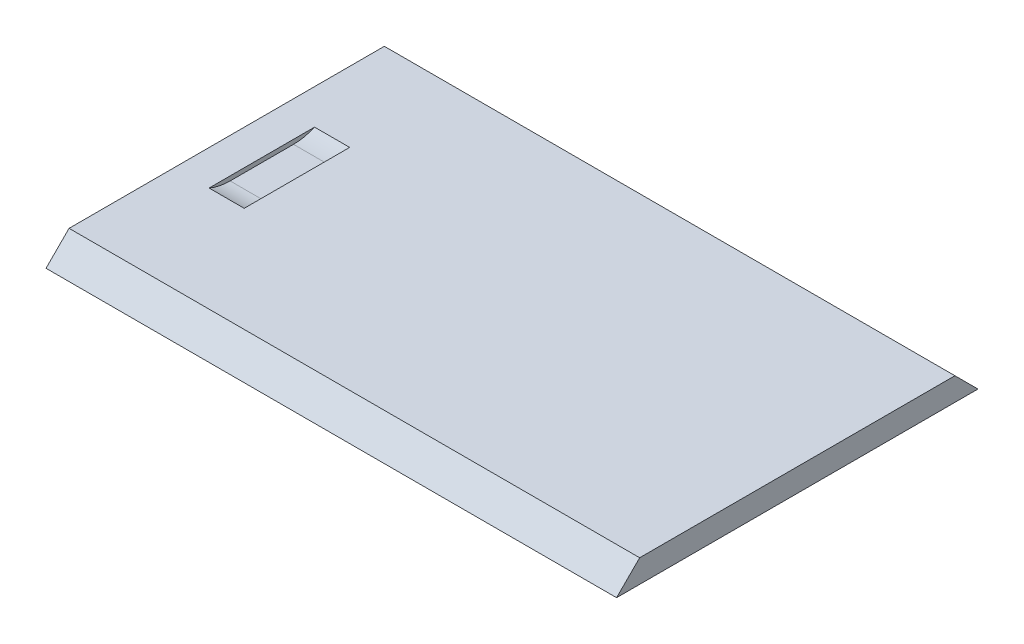
ISO-10303-21;
HEADER;
FILE_DESCRIPTION(('STEP AP214'),'2;1');
FILE_NAME('part.step','',(''),(''),'','','');
FILE_SCHEMA(('AUTOMOTIVE_DESIGN { 1 0 10303 214 1 1 1 1 }'));
ENDSEC;
DATA;
#1=APPLICATION_CONTEXT('core data for automotive mechanical design processes');
#2=APPLICATION_PROTOCOL_DEFINITION('international standard','automotive_design',2000,#1);
#3=PRODUCT_CONTEXT('',#1,'mechanical');
#4=PRODUCT('Part','Part','',(#3));
#5=PRODUCT_RELATED_PRODUCT_CATEGORY('part','',(#4));
#6=PRODUCT_DEFINITION_FORMATION('','',#4);
#7=PRODUCT_DEFINITION_CONTEXT('part definition',#1,'design');
#8=PRODUCT_DEFINITION('design','',#6,#7);
#9=PRODUCT_DEFINITION_SHAPE('','',#8);
#10=(LENGTH_UNIT() NAMED_UNIT(*) SI_UNIT(.MILLI.,.METRE.));
#11=(NAMED_UNIT(*) PLANE_ANGLE_UNIT() SI_UNIT($,.RADIAN.));
#12=(NAMED_UNIT(*) SI_UNIT($,.STERADIAN.) SOLID_ANGLE_UNIT());
#13=UNCERTAINTY_MEASURE_WITH_UNIT(LENGTH_MEASURE(1.E-05),#10,'distance_accuracy_value','');
#14=(GEOMETRIC_REPRESENTATION_CONTEXT(3) GLOBAL_UNCERTAINTY_ASSIGNED_CONTEXT((#13)) GLOBAL_UNIT_ASSIGNED_CONTEXT((#10,
#11,#12)) REPRESENTATION_CONTEXT('',''));
#15=CARTESIAN_POINT('',(0.,0.,0.));
#16=DIRECTION('',(0.,0.,1.));
#17=DIRECTION('',(1.,0.,0.));
#18=AXIS2_PLACEMENT_3D('',#15,#16,#17);
#19=CARTESIAN_POINT('',(-230.550293706294,36.2497951031447,0.));
#20=DIRECTION('',(0.,-1.,0.));
#21=DIRECTION('',(0.,0.,-1.));
#22=AXIS2_PLACEMENT_3D('',#19,#20,#21);
#23=PLANE('',#22);
#24=DIRECTION('',(0.,0.,-1.));
#25=VECTOR('',#24,1.);
#26=CARTESIAN_POINT('',(-65.4502937062937,36.2497951031447,0.));
#27=LINE('',#26,#25);
#28=CARTESIAN_POINT('',(-65.4502937062937,36.2497951031447,57.5210855611035));
#29=VERTEX_POINT('',#28);
#30=CARTESIAN_POINT('',(-65.4502937062937,36.2497951031447,-47.0609037429215));
#31=VERTEX_POINT('',#30);
#32=EDGE_CURVE('E155',#29,#31,#27,.T.);
#33=ORIENTED_EDGE('',*,*,#32,.F.);
#34=DIRECTION('',(1.,0.,0.));
#35=VECTOR('',#34,1.);
#36=CARTESIAN_POINT('',(-230.550293706294,36.2497951031447,57.5210855611035));
#37=LINE('',#36,#35);
#38=CARTESIAN_POINT('',(-230.550293706294,36.2497951031447,57.5210855611035));
#39=VERTEX_POINT('',#38);
#40=EDGE_CURVE('E178',#39,#29,#37,.T.);
#41=ORIENTED_EDGE('',*,*,#40,.F.);
#42=DIRECTION('',(0.,0.,-1.));
#43=VECTOR('',#42,1.);
#44=CARTESIAN_POINT('',(-230.550293706294,36.2497951031447,0.));
#45=LINE('',#44,#43);
#46=CARTESIAN_POINT('',(-230.550293706294,36.2497951031447,-47.0609037429215));
#47=VERTEX_POINT('',#46);
#48=EDGE_CURVE('E137',#39,#47,#45,.T.);
#49=ORIENTED_EDGE('',*,*,#48,.T.);
#50=DIRECTION('',(1.,0.,0.));
#51=VECTOR('',#50,1.);
#52=CARTESIAN_POINT('',(-230.550293706294,36.2497951031447,-47.0609037429215));
#53=LINE('',#52,#51);
#54=EDGE_CURVE('E154',#47,#31,#53,.T.);
#55=ORIENTED_EDGE('',*,*,#54,.T.);
#56=EDGE_LOOP('',(#33,#41,#49,#55));
#57=FACE_BOUND('',#56,.T.);
#58=ADVANCED_FACE('F44',(#57),#23,.T.);
#59=CARTESIAN_POINT('',(-230.550293706294,46.8854403321243,46.8854403321238));
#60=DIRECTION('',(0.,0.707106781186551,0.707106781186544));
#61=DIRECTION('',(0.,-0.707106781186544,0.707106781186551));
#62=AXIS2_PLACEMENT_3D('',#59,#60,#61);
#63=PLANE('',#62);
#64=DIRECTION('',(0.,-0.707106781186544,0.707106781186551));
#65=VECTOR('',#64,1.);
#66=CARTESIAN_POINT('',(-65.4502937062937,46.8854403321243,46.8854403321238));
#67=LINE('',#66,#65);
#68=CARTESIAN_POINT('',(-65.4502937062937,42.926,50.8448806642482));
#69=VERTEX_POINT('',#68);
#70=EDGE_CURVE('E159',#69,#29,#67,.T.);
#71=ORIENTED_EDGE('',*,*,#70,.F.);
#72=DIRECTION('',(1.,0.,0.));
#73=VECTOR('',#72,1.);
#74=CARTESIAN_POINT('',(-230.550293706294,42.926,50.8448806642482));
#75=LINE('',#74,#73);
#76=CARTESIAN_POINT('',(-230.550293706294,42.926,50.8448806642482));
#77=VERTEX_POINT('',#76);
#78=EDGE_CURVE('E175',#77,#69,#75,.T.);
#79=ORIENTED_EDGE('',*,*,#78,.F.);
#80=DIRECTION('',(0.,-0.707106781186544,0.707106781186551));
#81=VECTOR('',#80,1.);
#82=CARTESIAN_POINT('',(-230.550293706294,46.8854403321243,46.8854403321238));
#83=LINE('',#82,#81);
#84=EDGE_CURVE('E141',#77,#39,#83,.T.);
#85=ORIENTED_EDGE('',*,*,#84,.T.);
#86=ORIENTED_EDGE('',*,*,#40,.T.);
#87=EDGE_LOOP('',(#71,#79,#85,#86));
#88=FACE_BOUND('',#87,.T.);
#89=ADVANCED_FACE('F209',(#88),#63,.T.);
#90=CARTESIAN_POINT('',(-230.550293706294,42.926,0.));
#91=DIRECTION('',(0.,1.,0.));
#92=DIRECTION('',(0.,0.,1.));
#93=AXIS2_PLACEMENT_3D('',#90,#91,#92);
#94=PLANE('',#93);
#95=DIRECTION('',(0.,0.,1.));
#96=VECTOR('',#95,1.);
#97=CARTESIAN_POINT('',(-220.390293706294,42.926,-10.0316988460663));
#98=LINE('',#97,#96);
#99=CARTESIAN_POINT('',(-220.390293706294,42.926,-10.0316988460663));
#100=VERTEX_POINT('',#99);
#101=CARTESIAN_POINT('',(-220.390293706294,42.926,20.4918806642482));
#102=VERTEX_POINT('',#101);
#103=EDGE_CURVE('E128',#100,#102,#98,.T.);
#104=ORIENTED_EDGE('',*,*,#103,.F.);
#105=DIRECTION('',(-1.,0.,0.));
#106=VECTOR('',#105,1.);
#107=CARTESIAN_POINT('',(-220.390293706294,42.926,-10.0316988460663));
#108=LINE('',#107,#106);
#109=CARTESIAN_POINT('',(-210.230293706294,42.926,-10.0316988460663));
#110=VERTEX_POINT('',#109);
#111=EDGE_CURVE('E123',#110,#100,#108,.T.);
#112=ORIENTED_EDGE('',*,*,#111,.F.);
#113=DIRECTION('',(0.,0.,-1.));
#114=VECTOR('',#113,1.);
#115=CARTESIAN_POINT('',(-210.230293706294,42.926,-10.0316988460663));
#116=LINE('',#115,#114);
#117=CARTESIAN_POINT('',(-210.230293706294,42.926,20.4918806642482));
#118=VERTEX_POINT('',#117);
#119=EDGE_CURVE('E110',#118,#110,#116,.T.);
#120=ORIENTED_EDGE('',*,*,#119,.F.);
#121=DIRECTION('',(1.,0.,0.));
#122=VECTOR('',#121,1.);
#123=CARTESIAN_POINT('',(-220.390293706294,42.926,20.4918806642482));
#124=LINE('',#123,#122);
#125=EDGE_CURVE('E120',#102,#118,#124,.T.);
#126=ORIENTED_EDGE('',*,*,#125,.F.);
#127=EDGE_LOOP('',(#104,#112,#120,#126));
#128=FACE_BOUND('',#127,.T.);
#129=DIRECTION('',(0.,0.,1.));
#130=VECTOR('',#129,1.);
#131=CARTESIAN_POINT('',(-65.4502937062937,42.926,0.));
#132=LINE('',#131,#130);
#133=CARTESIAN_POINT('',(-65.4502937062937,42.926,-40.3846988460663));
#134=VERTEX_POINT('',#133);
#135=EDGE_CURVE('E163',#134,#69,#132,.T.);
#136=ORIENTED_EDGE('',*,*,#135,.F.);
#137=DIRECTION('',(1.,0.,0.));
#138=VECTOR('',#137,1.);
#139=CARTESIAN_POINT('',(-230.550293706294,42.926,-40.3846988460663));
#140=LINE('',#139,#138);
#141=CARTESIAN_POINT('',(-230.550293706294,42.926,-40.3846988460663));
#142=VERTEX_POINT('',#141);
#143=EDGE_CURVE('E172',#142,#134,#140,.T.);
#144=ORIENTED_EDGE('',*,*,#143,.F.);
#145=DIRECTION('',(0.,0.,1.));
#146=VECTOR('',#145,1.);
#147=CARTESIAN_POINT('',(-230.550293706294,42.926,0.));
#148=LINE('',#147,#146);
#149=EDGE_CURVE('E146',#142,#77,#148,.T.);
#150=ORIENTED_EDGE('',*,*,#149,.T.);
#151=ORIENTED_EDGE('',*,*,#78,.T.);
#152=EDGE_LOOP('',(#136,#144,#150,#151));
#153=FACE_BOUND('',#152,.T.);
#154=ADVANCED_FACE('F118',(#128,#153),#94,.T.);
#155=CARTESIAN_POINT('',(-230.550293706294,41.6553494230329,-41.6553494230334));
#156=DIRECTION('',(0.,0.707106781186544,-0.707106781186552));
#157=DIRECTION('',(0.,0.707106781186552,0.707106781186544));
#158=AXIS2_PLACEMENT_3D('',#155,#156,#157);
#159=PLANE('',#158);
#160=DIRECTION('',(0.,0.707106781186552,0.707106781186544));
#161=VECTOR('',#160,1.);
#162=CARTESIAN_POINT('',(-65.4502937062937,41.6553494230329,-41.6553494230334));
#163=LINE('',#162,#161);
#164=EDGE_CURVE('E142',#31,#134,#163,.T.);
#165=ORIENTED_EDGE('',*,*,#164,.F.);
#166=ORIENTED_EDGE('',*,*,#54,.F.);
#167=DIRECTION('',(0.,0.707106781186552,0.707106781186544));
#168=VECTOR('',#167,1.);
#169=CARTESIAN_POINT('',(-230.550293706294,41.6553494230329,-41.6553494230334));
#170=LINE('',#169,#168);
#171=EDGE_CURVE('E150',#47,#142,#170,.T.);
#172=ORIENTED_EDGE('',*,*,#171,.T.);
#173=ORIENTED_EDGE('',*,*,#143,.T.);
#174=EDGE_LOOP('',(#165,#166,#172,#173));
#175=FACE_BOUND('',#174,.T.);
#176=ADVANCED_FACE('F221',(#175),#159,.T.);
#177=CARTESIAN_POINT('',(-230.550293706294,0.,0.));
#178=DIRECTION('',(-1.,0.,0.));
#179=DIRECTION('',(0.,0.,1.));
#180=AXIS2_PLACEMENT_3D('',#177,#178,#179);
#181=PLANE('',#180);
#182=ORIENTED_EDGE('',*,*,#48,.F.);
#183=ORIENTED_EDGE('',*,*,#84,.F.);
#184=ORIENTED_EDGE('',*,*,#149,.F.);
#185=ORIENTED_EDGE('',*,*,#171,.F.);
#186=EDGE_LOOP('',(#182,#183,#184,#185));
#187=FACE_BOUND('',#186,.T.);
#188=ADVANCED_FACE('F224',(#187),#181,.T.);
#189=CARTESIAN_POINT('',(-65.4502937062937,0.,0.));
#190=DIRECTION('',(-1.,0.,0.));
#191=DIRECTION('',(0.,0.,1.));
#192=AXIS2_PLACEMENT_3D('',#189,#190,#191);
#193=PLANE('',#192);
#194=ORIENTED_EDGE('',*,*,#32,.T.);
#195=ORIENTED_EDGE('',*,*,#164,.T.);
#196=ORIENTED_EDGE('',*,*,#135,.T.);
#197=ORIENTED_EDGE('',*,*,#70,.T.);
#198=EDGE_LOOP('',(#194,#195,#196,#197));
#199=FACE_BOUND('',#198,.T.);
#200=ADVANCED_FACE('F226',(#199),#193,.F.);
#201=CARTESIAN_POINT('',(-220.390293706294,41.656,-10.0316988460663));
#202=DIRECTION('',(-1.,0.,0.));
#203=DIRECTION('',(0.,0.,1.));
#204=AXIS2_PLACEMENT_3D('',#201,#202,#203);
#205=PLANE('',#204);
#206=ORIENTED_EDGE('',*,*,#103,.T.);
#207=CARTESIAN_POINT('',(-220.390293706294,56.896,14.401174629641));
#208=DIRECTION('',(-1.,0.,0.));
#209=DIRECTION('',(0.,0.,1.));
#210=AXIS2_PLACEMENT_3D('',#207,#208,#209);
#211=CIRCLE('',#210,15.24);
#212=CARTESIAN_POINT('',(-220.390293706294,41.656,14.401174629641));
#213=VERTEX_POINT('',#212);
#214=EDGE_CURVE('E11',#102,#213,#211,.F.);
#215=ORIENTED_EDGE('',*,*,#214,.T.);
#216=DIRECTION('',(0.,0.,1.));
#217=VECTOR('',#216,1.);
#218=CARTESIAN_POINT('',(-220.390293706294,41.656,-10.0316988460663));
#219=LINE('',#218,#217);
#220=CARTESIAN_POINT('',(-220.390293706294,41.656,-3.94099281145913));
#221=VERTEX_POINT('',#220);
#222=EDGE_CURVE('E136',#221,#213,#219,.T.);
#223=ORIENTED_EDGE('',*,*,#222,.F.);
#224=CARTESIAN_POINT('',(-220.390293706294,56.896,-3.94099281145913));
#225=DIRECTION('',(-1.,0.,0.));
#226=DIRECTION('',(0.,0.,1.));
#227=AXIS2_PLACEMENT_3D('',#224,#225,#226);
#228=CIRCLE('',#227,15.24);
#229=EDGE_CURVE('E53',#221,#100,#228,.F.);
#230=ORIENTED_EDGE('',*,*,#229,.T.);
#231=EDGE_LOOP('',(#206,#215,#223,#230));
#232=FACE_BOUND('',#231,.T.);
#233=ADVANCED_FACE('F192',(#232),#205,.F.);
#234=CARTESIAN_POINT('',(-210.230293706294,41.656,-10.0316988460663));
#235=DIRECTION('',(1.,0.,0.));
#236=DIRECTION('',(0.,0.,-1.));
#237=AXIS2_PLACEMENT_3D('',#234,#235,#236);
#238=PLANE('',#237);
#239=DIRECTION('',(0.,0.,-1.));
#240=VECTOR('',#239,1.);
#241=CARTESIAN_POINT('',(-210.230293706294,41.656,-10.0316988460663));
#242=LINE('',#241,#240);
#243=CARTESIAN_POINT('',(-210.230293706294,41.656,14.401174629641));
#244=VERTEX_POINT('',#243);
#245=CARTESIAN_POINT('',(-210.230293706294,41.656,-3.94099281145913));
#246=VERTEX_POINT('',#245);
#247=EDGE_CURVE('E112',#244,#246,#242,.T.);
#248=ORIENTED_EDGE('',*,*,#247,.F.);
#249=CARTESIAN_POINT('',(-210.230293706294,56.896,14.401174629641));
#250=DIRECTION('',(1.,0.,0.));
#251=DIRECTION('',(0.,0.,-1.));
#252=AXIS2_PLACEMENT_3D('',#249,#250,#251);
#253=CIRCLE('',#252,15.24);
#254=EDGE_CURVE('E68',#244,#118,#253,.F.);
#255=ORIENTED_EDGE('',*,*,#254,.T.);
#256=ORIENTED_EDGE('',*,*,#119,.T.);
#257=CARTESIAN_POINT('',(-210.230293706294,56.896,-3.94099281145913));
#258=DIRECTION('',(1.,0.,0.));
#259=DIRECTION('',(0.,0.,-1.));
#260=AXIS2_PLACEMENT_3D('',#257,#258,#259);
#261=CIRCLE('',#260,15.24);
#262=EDGE_CURVE('E60',#110,#246,#261,.F.);
#263=ORIENTED_EDGE('',*,*,#262,.T.);
#264=EDGE_LOOP('',(#248,#255,#256,#263));
#265=FACE_BOUND('',#264,.T.);
#266=ADVANCED_FACE('F109',(#265),#238,.F.);
#267=CARTESIAN_POINT('',(0.,41.656,0.));
#268=DIRECTION('',(0.,1.,0.));
#269=DIRECTION('',(0.,0.,1.));
#270=AXIS2_PLACEMENT_3D('',#267,#268,#269);
#271=PLANE('',#270);
#272=ORIENTED_EDGE('',*,*,#222,.T.);
#273=DIRECTION('',(1.,0.,0.));
#274=VECTOR('',#273,1.);
#275=CARTESIAN_POINT('',(-210.230293706294,41.656,14.401174629641));
#276=LINE('',#275,#274);
#277=EDGE_CURVE('E185',#213,#244,#276,.T.);
#278=ORIENTED_EDGE('',*,*,#277,.T.);
#279=ORIENTED_EDGE('',*,*,#247,.T.);
#280=DIRECTION('',(-1.,0.,0.));
#281=VECTOR('',#280,1.);
#282=CARTESIAN_POINT('',(-220.390293706294,41.656,-3.94099281145913));
#283=LINE('',#282,#281);
#284=EDGE_CURVE('E181',#246,#221,#283,.T.);
#285=ORIENTED_EDGE('',*,*,#284,.T.);
#286=EDGE_LOOP('',(#272,#278,#279,#285));
#287=FACE_BOUND('',#286,.T.);
#288=ADVANCED_FACE('F197',(#287),#271,.T.);
#289=CARTESIAN_POINT('',(-220.390293706294,56.896,14.401174629641));
#290=DIRECTION('',(-1.,0.,0.));
#291=DIRECTION('',(0.,0.,1.));
#292=AXIS2_PLACEMENT_3D('',#289,#290,#291);
#293=CYLINDRICAL_SURFACE('',#292,15.24);
#294=ORIENTED_EDGE('',*,*,#214,.F.);
#295=ORIENTED_EDGE('',*,*,#125,.T.);
#296=ORIENTED_EDGE('',*,*,#254,.F.);
#297=ORIENTED_EDGE('',*,*,#277,.F.);
#298=EDGE_LOOP('',(#294,#295,#296,#297));
#299=FACE_BOUND('',#298,.T.);
#300=ADVANCED_FACE('F126',(#299),#293,.F.);
#301=CARTESIAN_POINT('',(-220.390293706294,56.896,-3.94099281145913));
#302=DIRECTION('',(1.,0.,0.));
#303=DIRECTION('',(0.,0.,-1.));
#304=AXIS2_PLACEMENT_3D('',#301,#302,#303);
#305=CYLINDRICAL_SURFACE('',#304,15.24);
#306=ORIENTED_EDGE('',*,*,#262,.F.);
#307=ORIENTED_EDGE('',*,*,#111,.T.);
#308=ORIENTED_EDGE('',*,*,#229,.F.);
#309=ORIENTED_EDGE('',*,*,#284,.F.);
#310=EDGE_LOOP('',(#306,#307,#308,#309));
#311=FACE_BOUND('',#310,.T.);
#312=ADVANCED_FACE('F46',(#311),#305,.F.);
#313=CLOSED_SHELL('',(#58,#89,#154,#176,#188,#200,#233,#266,#288,#300,#312));
#314=MANIFOLD_SOLID_BREP('B2',#313);
#315=ADVANCED_BREP_SHAPE_REPRESENTATION('',(#18,#314),#14);
#316=SHAPE_DEFINITION_REPRESENTATION(#9,#315);
ENDSEC;
END-ISO-10303-21;
